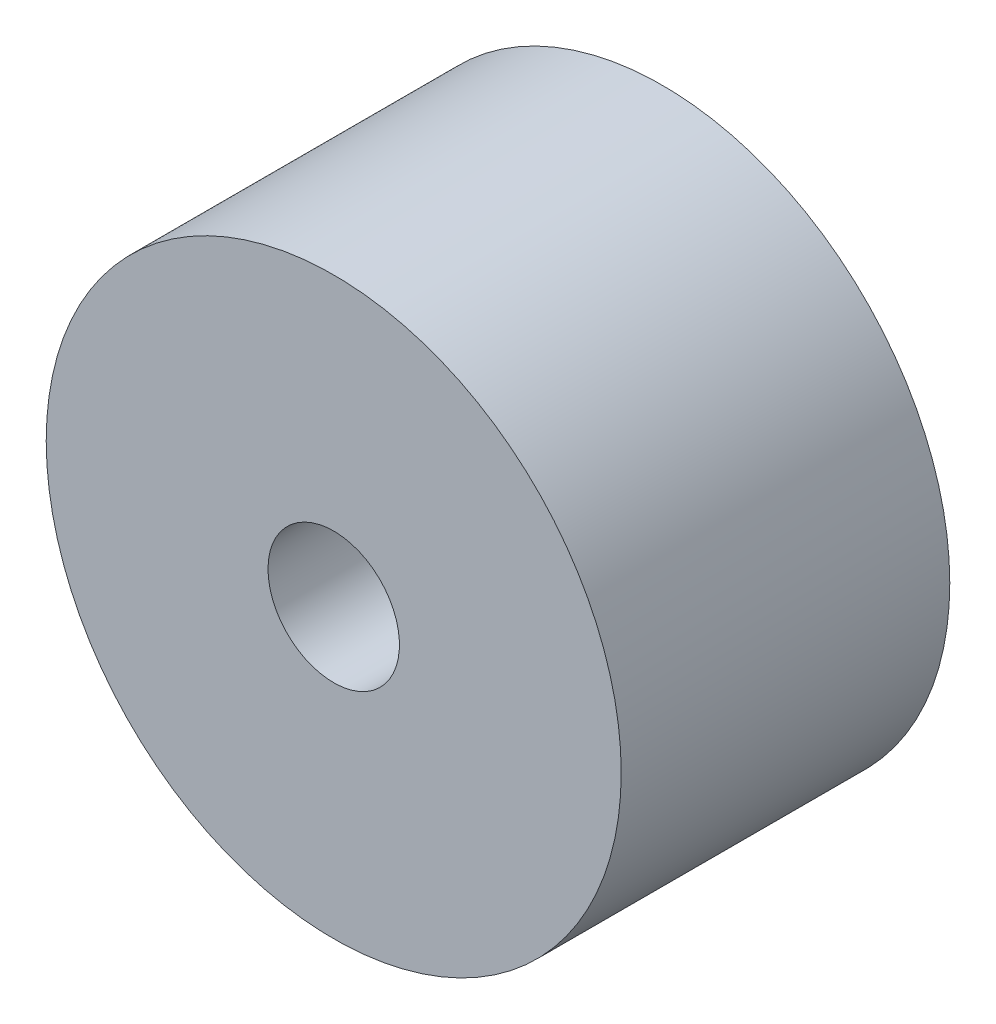
ISO-10303-21;
HEADER;
FILE_DESCRIPTION(('STEP AP214'),'2;1');
FILE_NAME('part.step','',(''),(''),'','','');
FILE_SCHEMA(('AUTOMOTIVE_DESIGN { 1 0 10303 214 1 1 1 1 }'));
ENDSEC;
DATA;
#1=APPLICATION_CONTEXT('core data for automotive mechanical design processes');
#2=APPLICATION_PROTOCOL_DEFINITION('international standard','automotive_design',2000,#1);
#3=PRODUCT_CONTEXT('',#1,'mechanical');
#4=PRODUCT('Part','Part','',(#3));
#5=PRODUCT_RELATED_PRODUCT_CATEGORY('part','',(#4));
#6=PRODUCT_DEFINITION_FORMATION('','',#4);
#7=PRODUCT_DEFINITION_CONTEXT('part definition',#1,'design');
#8=PRODUCT_DEFINITION('design','',#6,#7);
#9=PRODUCT_DEFINITION_SHAPE('','',#8);
#10=(LENGTH_UNIT() NAMED_UNIT(*) SI_UNIT(.MILLI.,.METRE.));
#11=(NAMED_UNIT(*) PLANE_ANGLE_UNIT() SI_UNIT($,.RADIAN.));
#12=(NAMED_UNIT(*) SI_UNIT($,.STERADIAN.) SOLID_ANGLE_UNIT());
#13=UNCERTAINTY_MEASURE_WITH_UNIT(LENGTH_MEASURE(1.E-05),#10,'distance_accuracy_value','');
#14=(GEOMETRIC_REPRESENTATION_CONTEXT(3) GLOBAL_UNCERTAINTY_ASSIGNED_CONTEXT((#13)) GLOBAL_UNIT_ASSIGNED_CONTEXT((#10,
#11,#12)) REPRESENTATION_CONTEXT('',''));
#15=CARTESIAN_POINT('',(0.,0.,0.));
#16=DIRECTION('',(0.,0.,1.));
#17=DIRECTION('',(1.,0.,0.));
#18=AXIS2_PLACEMENT_3D('',#15,#16,#17);
#19=CARTESIAN_POINT('',(0.,0.,20.));
#20=DIRECTION('',(0.,0.,-1.));
#21=DIRECTION('',(-1.,0.,0.));
#22=AXIS2_PLACEMENT_3D('',#19,#20,#21);
#23=CYLINDRICAL_SURFACE('',#22,17.5);
#24=CARTESIAN_POINT('',(0.,0.,20.));
#25=DIRECTION('',(0.,0.,1.));
#26=DIRECTION('',(1.,0.,0.));
#27=AXIS2_PLACEMENT_3D('',#24,#25,#26);
#28=CIRCLE('',#27,17.5);
#29=CARTESIAN_POINT('',(17.5,0.,20.));
#30=VERTEX_POINT('',#29);
#31=EDGE_CURVE('E10',#30,#30,#28,.T.);
#32=ORIENTED_EDGE('',*,*,#31,.F.);
#33=EDGE_LOOP('',(#32));
#34=FACE_BOUND('',#33,.T.);
#35=CARTESIAN_POINT('',(0.,0.,0.));
#36=DIRECTION('',(0.,0.,1.));
#37=DIRECTION('',(1.,0.,0.));
#38=AXIS2_PLACEMENT_3D('',#35,#36,#37);
#39=CIRCLE('',#38,17.5);
#40=CARTESIAN_POINT('',(17.5,0.,0.));
#41=VERTEX_POINT('',#40);
#42=EDGE_CURVE('E36',#41,#41,#39,.T.);
#43=ORIENTED_EDGE('',*,*,#42,.T.);
#44=EDGE_LOOP('',(#43));
#45=FACE_BOUND('',#44,.T.);
#46=ADVANCED_FACE('F33',(#34,#45),#23,.T.);
#47=CARTESIAN_POINT('',(0.,0.,20.));
#48=DIRECTION('',(0.,0.,1.));
#49=DIRECTION('',(1.,0.,0.));
#50=AXIS2_PLACEMENT_3D('',#47,#48,#49);
#51=PLANE('',#50);
#52=CARTESIAN_POINT('',(0.,0.,20.));
#53=DIRECTION('',(0.,0.,-1.));
#54=DIRECTION('',(-1.,0.,0.));
#55=AXIS2_PLACEMENT_3D('',#52,#53,#54);
#56=CIRCLE('',#55,4.);
#57=CARTESIAN_POINT('',(-4.,0.,20.));
#58=VERTEX_POINT('',#57);
#59=EDGE_CURVE('E43',#58,#58,#56,.T.);
#60=ORIENTED_EDGE('',*,*,#59,.T.);
#61=EDGE_LOOP('',(#60));
#62=FACE_BOUND('',#61,.T.);
#63=ORIENTED_EDGE('',*,*,#31,.T.);
#64=EDGE_LOOP('',(#63));
#65=FACE_BOUND('',#64,.T.);
#66=ADVANCED_FACE('F51',(#62,#65),#51,.T.);
#67=CARTESIAN_POINT('',(0.,0.,0.));
#68=DIRECTION('',(0.,0.,1.));
#69=DIRECTION('',(1.,0.,0.));
#70=AXIS2_PLACEMENT_3D('',#67,#68,#69);
#71=PLANE('',#70);
#72=CARTESIAN_POINT('',(0.,0.,0.));
#73=DIRECTION('',(0.,0.,-1.));
#74=DIRECTION('',(-1.,0.,0.));
#75=AXIS2_PLACEMENT_3D('',#72,#73,#74);
#76=CIRCLE('',#75,4.);
#77=CARTESIAN_POINT('',(-4.,0.,0.));
#78=VERTEX_POINT('',#77);
#79=EDGE_CURVE('E45',#78,#78,#76,.T.);
#80=ORIENTED_EDGE('',*,*,#79,.F.);
#81=EDGE_LOOP('',(#80));
#82=FACE_BOUND('',#81,.T.);
#83=ORIENTED_EDGE('',*,*,#42,.F.);
#84=EDGE_LOOP('',(#83));
#85=FACE_BOUND('',#84,.T.);
#86=ADVANCED_FACE('F56',(#82,#85),#71,.F.);
#87=CARTESIAN_POINT('',(0.,0.,20.));
#88=DIRECTION('',(0.,0.,-1.));
#89=DIRECTION('',(-1.,0.,0.));
#90=AXIS2_PLACEMENT_3D('',#87,#88,#89);
#91=CYLINDRICAL_SURFACE('',#90,4.);
#92=ORIENTED_EDGE('',*,*,#59,.F.);
#93=EDGE_LOOP('',(#92));
#94=FACE_BOUND('',#93,.T.);
#95=ORIENTED_EDGE('',*,*,#79,.T.);
#96=EDGE_LOOP('',(#95));
#97=FACE_BOUND('',#96,.T.);
#98=ADVANCED_FACE('F53',(#94,#97),#91,.F.);
#99=CLOSED_SHELL('',(#46,#66,#86,#98));
#100=MANIFOLD_SOLID_BREP('B2',#99);
#101=ADVANCED_BREP_SHAPE_REPRESENTATION('',(#18,#100),#14);
#102=SHAPE_DEFINITION_REPRESENTATION(#9,#101);
ENDSEC;
END-ISO-10303-21;
